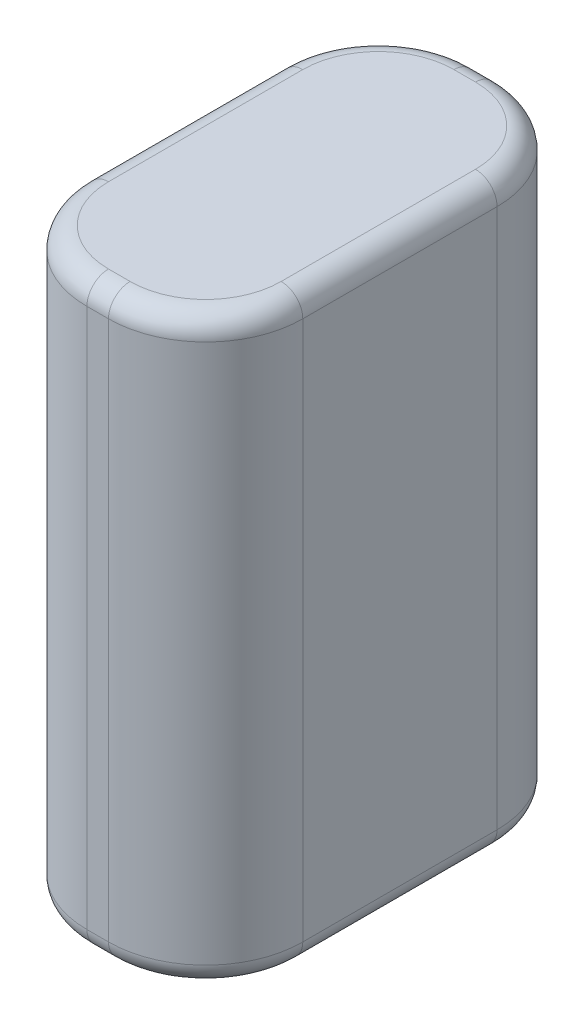
ISO-10303-21;
HEADER;
FILE_DESCRIPTION(('STEP AP214'),'2;1');
FILE_NAME('part.step','',(''),(''),'','','');
FILE_SCHEMA(('AUTOMOTIVE_DESIGN { 1 0 10303 214 1 1 1 1 }'));
ENDSEC;
DATA;
#1=APPLICATION_CONTEXT('core data for automotive mechanical design processes');
#2=APPLICATION_PROTOCOL_DEFINITION('international standard','automotive_design',2000,#1);
#3=PRODUCT_CONTEXT('',#1,'mechanical');
#4=PRODUCT('Part','Part','',(#3));
#5=PRODUCT_RELATED_PRODUCT_CATEGORY('part','',(#4));
#6=PRODUCT_DEFINITION_FORMATION('','',#4);
#7=PRODUCT_DEFINITION_CONTEXT('part definition',#1,'design');
#8=PRODUCT_DEFINITION('design','',#6,#7);
#9=PRODUCT_DEFINITION_SHAPE('','',#8);
#10=(LENGTH_UNIT() NAMED_UNIT(*) SI_UNIT(.MILLI.,.METRE.));
#11=(NAMED_UNIT(*) PLANE_ANGLE_UNIT() SI_UNIT($,.RADIAN.));
#12=(NAMED_UNIT(*) SI_UNIT($,.STERADIAN.) SOLID_ANGLE_UNIT());
#13=UNCERTAINTY_MEASURE_WITH_UNIT(LENGTH_MEASURE(1.E-05),#10,'distance_accuracy_value','');
#14=(GEOMETRIC_REPRESENTATION_CONTEXT(3) GLOBAL_UNCERTAINTY_ASSIGNED_CONTEXT((#13)) GLOBAL_UNIT_ASSIGNED_CONTEXT((#10,
#11,#12)) REPRESENTATION_CONTEXT('',''));
#15=CARTESIAN_POINT('',(0.,0.,0.));
#16=DIRECTION('',(0.,0.,1.));
#17=DIRECTION('',(1.,0.,0.));
#18=AXIS2_PLACEMENT_3D('',#15,#16,#17);
#19=CARTESIAN_POINT('',(5.,0.,9.));
#20=DIRECTION('',(1.,0.,0.));
#21=DIRECTION('',(0.,0.,-1.));
#22=AXIS2_PLACEMENT_3D('',#19,#20,#21);
#23=PLANE('',#22);
#24=DIRECTION('',(0.,-1.,0.));
#25=VECTOR('',#24,1.);
#26=CARTESIAN_POINT('',(5.,0.,-4.5));
#27=LINE('',#26,#25);
#28=CARTESIAN_POINT('',(5.,-1.,-4.5));
#29=VERTEX_POINT('',#28);
#30=CARTESIAN_POINT('',(5.,-26.,-4.49999999999999));
#31=VERTEX_POINT('',#30);
#32=EDGE_CURVE('E131',#29,#31,#27,.T.);
#33=ORIENTED_EDGE('',*,*,#32,.F.);
#34=DIRECTION('',(0.,0.,1.));
#35=VECTOR('',#34,1.);
#36=CARTESIAN_POINT('',(5.,-1.,-4.5));
#37=LINE('',#36,#35);
#38=CARTESIAN_POINT('',(5.,-1.,4.5));
#39=VERTEX_POINT('',#38);
#40=EDGE_CURVE('E178',#39,#29,#37,.F.);
#41=ORIENTED_EDGE('',*,*,#40,.F.);
#42=DIRECTION('',(0.,-1.,0.));
#43=VECTOR('',#42,1.);
#44=CARTESIAN_POINT('',(5.,0.,4.49999999999998));
#45=LINE('',#44,#43);
#46=CARTESIAN_POINT('',(5.,-26.,4.5));
#47=VERTEX_POINT('',#46);
#48=EDGE_CURVE('E133',#47,#39,#45,.F.);
#49=ORIENTED_EDGE('',*,*,#48,.F.);
#50=DIRECTION('',(0.,0.,-1.));
#51=VECTOR('',#50,1.);
#52=CARTESIAN_POINT('',(5.,-26.,4.5));
#53=LINE('',#52,#51);
#54=EDGE_CURVE('E127',#31,#47,#53,.F.);
#55=ORIENTED_EDGE('',*,*,#54,.F.);
#56=EDGE_LOOP('',(#33,#41,#49,#55));
#57=FACE_BOUND('',#56,.T.);
#58=ADVANCED_FACE('F17',(#57),#23,.T.);
#59=CARTESIAN_POINT('',(0.5,0.,-4.5));
#60=DIRECTION('',(0.,-1.,0.));
#61=DIRECTION('',(0.,0.,-1.));
#62=AXIS2_PLACEMENT_3D('',#59,#60,#61);
#63=CYLINDRICAL_SURFACE('',#62,4.5);
#64=CARTESIAN_POINT('',(0.5,-1.,-4.5));
#65=DIRECTION('',(0.,-1.,0.));
#66=DIRECTION('',(0.,0.,-1.));
#67=AXIS2_PLACEMENT_3D('',#64,#65,#66);
#68=CIRCLE('',#67,4.5);
#69=CARTESIAN_POINT('',(0.5,-1.,-9.));
#70=VERTEX_POINT('',#69);
#71=EDGE_CURVE('E152',#29,#70,#68,.F.);
#72=ORIENTED_EDGE('',*,*,#71,.F.);
#73=ORIENTED_EDGE('',*,*,#32,.T.);
#74=CARTESIAN_POINT('',(0.5,-26.,-4.5));
#75=DIRECTION('',(0.,1.,0.));
#76=DIRECTION('',(1.,0.,0.));
#77=AXIS2_PLACEMENT_3D('',#74,#75,#76);
#78=CIRCLE('',#77,4.5);
#79=CARTESIAN_POINT('',(0.5,-26.,-8.99999999999999));
#80=VERTEX_POINT('',#79);
#81=EDGE_CURVE('E145',#80,#31,#78,.F.);
#82=ORIENTED_EDGE('',*,*,#81,.F.);
#83=DIRECTION('',(0.,1.,0.));
#84=VECTOR('',#83,1.);
#85=CARTESIAN_POINT('',(0.5,0.,-9.));
#86=LINE('',#85,#84);
#87=EDGE_CURVE('E185',#70,#80,#86,.F.);
#88=ORIENTED_EDGE('',*,*,#87,.F.);
#89=EDGE_LOOP('',(#72,#73,#82,#88));
#90=FACE_BOUND('',#89,.T.);
#91=ADVANCED_FACE('F149',(#90),#63,.T.);
#92=CARTESIAN_POINT('',(0.5,-26.,4.5));
#93=DIRECTION('',(0.,1.,0.));
#94=DIRECTION('',(0.,0.,1.));
#95=AXIS2_PLACEMENT_3D('',#92,#93,#94);
#96=TOROIDAL_SURFACE('',#95,3.5,1.);
#97=CARTESIAN_POINT('',(4.,-26.,4.5));
#98=DIRECTION('',(0.,0.,-1.));
#99=DIRECTION('',(0.,1.,0.));
#100=AXIS2_PLACEMENT_3D('',#97,#98,#99);
#101=CIRCLE('',#100,1.);
#102=CARTESIAN_POINT('',(4.,-27.,4.5));
#103=VERTEX_POINT('',#102);
#104=EDGE_CURVE('E136',#47,#103,#101,.T.);
#105=ORIENTED_EDGE('',*,*,#104,.F.);
#106=CARTESIAN_POINT('',(0.5,-26.,4.50000000000002));
#107=DIRECTION('',(0.,-1.,0.));
#108=DIRECTION('',(0.,0.,-1.));
#109=AXIS2_PLACEMENT_3D('',#106,#107,#108);
#110=CIRCLE('',#109,4.5);
#111=CARTESIAN_POINT('',(0.5,-26.,9.00000000000001));
#112=VERTEX_POINT('',#111);
#113=EDGE_CURVE('E160',#112,#47,#110,.F.);
#114=ORIENTED_EDGE('',*,*,#113,.F.);
#115=CARTESIAN_POINT('',(0.5,-26.,8.));
#116=DIRECTION('',(1.,0.,0.));
#117=DIRECTION('',(0.,0.,-1.));
#118=AXIS2_PLACEMENT_3D('',#115,#116,#117);
#119=CIRCLE('',#118,1.);
#120=CARTESIAN_POINT('',(0.5,-27.,8.));
#121=VERTEX_POINT('',#120);
#122=EDGE_CURVE('E168',#121,#112,#119,.F.);
#123=ORIENTED_EDGE('',*,*,#122,.F.);
#124=CARTESIAN_POINT('',(0.5,-27.,4.5));
#125=DIRECTION('',(0.,1.,0.));
#126=DIRECTION('',(0.,0.,1.));
#127=AXIS2_PLACEMENT_3D('',#124,#125,#126);
#128=CIRCLE('',#127,3.5);
#129=EDGE_CURVE('E231',#121,#103,#128,.T.);
#130=ORIENTED_EDGE('',*,*,#129,.T.);
#131=EDGE_LOOP('',(#105,#114,#123,#130));
#132=FACE_BOUND('',#131,.T.);
#133=ADVANCED_FACE('F237',(#132),#96,.T.);
#134=CARTESIAN_POINT('',(4.,-26.,4.5));
#135=DIRECTION('',(0.,0.,-1.));
#136=DIRECTION('',(0.,1.,0.));
#137=AXIS2_PLACEMENT_3D('',#134,#135,#136);
#138=CYLINDRICAL_SURFACE('',#137,1.);
#139=ORIENTED_EDGE('',*,*,#54,.T.);
#140=ORIENTED_EDGE('',*,*,#104,.T.);
#141=DIRECTION('',(0.,0.,1.));
#142=VECTOR('',#141,1.);
#143=CARTESIAN_POINT('',(4.,-27.,0.));
#144=LINE('',#143,#142);
#145=CARTESIAN_POINT('',(4.,-27.,-4.5));
#146=VERTEX_POINT('',#145);
#147=EDGE_CURVE('E141',#103,#146,#144,.F.);
#148=ORIENTED_EDGE('',*,*,#147,.T.);
#149=CARTESIAN_POINT('',(4.,-26.,-4.5));
#150=DIRECTION('',(0.,0.,-1.));
#151=DIRECTION('',(1.,0.,0.));
#152=AXIS2_PLACEMENT_3D('',#149,#150,#151);
#153=CIRCLE('',#152,1.);
#154=EDGE_CURVE('E138',#31,#146,#153,.T.);
#155=ORIENTED_EDGE('',*,*,#154,.F.);
#156=EDGE_LOOP('',(#139,#140,#148,#155));
#157=FACE_BOUND('',#156,.T.);
#158=ADVANCED_FACE('F139',(#157),#138,.T.);
#159=CARTESIAN_POINT('',(0.5,-26.,-4.5));
#160=DIRECTION('',(0.,1.,0.));
#161=DIRECTION('',(1.,0.,0.));
#162=AXIS2_PLACEMENT_3D('',#159,#160,#161);
#163=TOROIDAL_SURFACE('',#162,3.5,1.);
#164=CARTESIAN_POINT('',(0.5,-26.,-8.));
#165=DIRECTION('',(-1.,0.,0.));
#166=DIRECTION('',(0.,0.,1.));
#167=AXIS2_PLACEMENT_3D('',#164,#165,#166);
#168=CIRCLE('',#167,1.);
#169=CARTESIAN_POINT('',(0.5,-27.,-8.));
#170=VERTEX_POINT('',#169);
#171=EDGE_CURVE('E157',#80,#170,#168,.T.);
#172=ORIENTED_EDGE('',*,*,#171,.F.);
#173=ORIENTED_EDGE('',*,*,#81,.T.);
#174=ORIENTED_EDGE('',*,*,#154,.T.);
#175=CARTESIAN_POINT('',(0.5,-27.,-4.5));
#176=DIRECTION('',(0.,1.,0.));
#177=DIRECTION('',(1.,0.,0.));
#178=AXIS2_PLACEMENT_3D('',#175,#176,#177);
#179=CIRCLE('',#178,3.5);
#180=EDGE_CURVE('E470',#146,#170,#179,.T.);
#181=ORIENTED_EDGE('',*,*,#180,.T.);
#182=EDGE_LOOP('',(#172,#173,#174,#181));
#183=FACE_BOUND('',#182,.T.);
#184=ADVANCED_FACE('F155',(#183),#163,.T.);
#185=CARTESIAN_POINT('',(0.5,-26.,-8.));
#186=DIRECTION('',(-1.,0.,0.));
#187=DIRECTION('',(0.,0.,1.));
#188=AXIS2_PLACEMENT_3D('',#185,#186,#187);
#189=CYLINDRICAL_SURFACE('',#188,1.);
#190=DIRECTION('',(1.,0.,0.));
#191=VECTOR('',#190,1.);
#192=CARTESIAN_POINT('',(5.,-26.,-8.99999999999998));
#193=LINE('',#192,#191);
#194=CARTESIAN_POINT('',(-0.5,-26.,-8.99999999999999));
#195=VERTEX_POINT('',#194);
#196=EDGE_CURVE('E188',#80,#195,#193,.F.);
#197=ORIENTED_EDGE('',*,*,#196,.F.);
#198=ORIENTED_EDGE('',*,*,#171,.T.);
#199=DIRECTION('',(1.,0.,0.));
#200=VECTOR('',#199,1.);
#201=CARTESIAN_POINT('',(0.,-27.,-8.));
#202=LINE('',#201,#200);
#203=CARTESIAN_POINT('',(-0.5,-27.,-8.));
#204=VERTEX_POINT('',#203);
#205=EDGE_CURVE('E468',#170,#204,#202,.F.);
#206=ORIENTED_EDGE('',*,*,#205,.T.);
#207=CARTESIAN_POINT('',(-0.5,-26.,-8.));
#208=DIRECTION('',(-1.,0.,0.));
#209=DIRECTION('',(0.,0.,-1.));
#210=AXIS2_PLACEMENT_3D('',#207,#208,#209);
#211=CIRCLE('',#210,1.);
#212=EDGE_CURVE('E278',#195,#204,#211,.T.);
#213=ORIENTED_EDGE('',*,*,#212,.F.);
#214=EDGE_LOOP('',(#197,#198,#206,#213));
#215=FACE_BOUND('',#214,.T.);
#216=ADVANCED_FACE('F267',(#215),#189,.T.);
#217=CARTESIAN_POINT('',(0.5,0.,4.5));
#218=DIRECTION('',(0.,-1.,0.));
#219=DIRECTION('',(0.,0.,-1.));
#220=AXIS2_PLACEMENT_3D('',#217,#218,#219);
#221=CYLINDRICAL_SURFACE('',#220,4.5);
#222=CARTESIAN_POINT('',(0.5,-1.,4.5));
#223=DIRECTION('',(0.,-1.,0.));
#224=DIRECTION('',(1.,0.,0.));
#225=AXIS2_PLACEMENT_3D('',#222,#223,#224);
#226=CIRCLE('',#225,4.5);
#227=CARTESIAN_POINT('',(0.5,-0.999999999999999,9.));
#228=VERTEX_POINT('',#227);
#229=EDGE_CURVE('E171',#228,#39,#226,.F.);
#230=ORIENTED_EDGE('',*,*,#229,.F.);
#231=DIRECTION('',(0.,-1.,0.));
#232=VECTOR('',#231,1.);
#233=CARTESIAN_POINT('',(0.5,0.,9.));
#234=LINE('',#233,#232);
#235=EDGE_CURVE('E501',#112,#228,#234,.F.);
#236=ORIENTED_EDGE('',*,*,#235,.F.);
#237=ORIENTED_EDGE('',*,*,#113,.T.);
#238=ORIENTED_EDGE('',*,*,#48,.T.);
#239=EDGE_LOOP('',(#230,#236,#237,#238));
#240=FACE_BOUND('',#239,.T.);
#241=ADVANCED_FACE('F622',(#240),#221,.T.);
#242=CARTESIAN_POINT('',(-0.5,-26.,8.));
#243=DIRECTION('',(1.,0.,0.));
#244=DIRECTION('',(0.,0.,-1.));
#245=AXIS2_PLACEMENT_3D('',#242,#243,#244);
#246=CYLINDRICAL_SURFACE('',#245,1.);
#247=DIRECTION('',(1.,0.,0.));
#248=VECTOR('',#247,1.);
#249=CARTESIAN_POINT('',(-5.,-26.,9.00000000000002));
#250=LINE('',#249,#248);
#251=CARTESIAN_POINT('',(-0.5,-26.,9.00000000000001));
#252=VERTEX_POINT('',#251);
#253=EDGE_CURVE('E464',#252,#112,#250,.T.);
#254=ORIENTED_EDGE('',*,*,#253,.F.);
#255=CARTESIAN_POINT('',(-0.5,-26.,8.));
#256=DIRECTION('',(1.,0.,0.));
#257=DIRECTION('',(0.,0.,1.));
#258=AXIS2_PLACEMENT_3D('',#255,#256,#257);
#259=CIRCLE('',#258,1.);
#260=CARTESIAN_POINT('',(-0.5,-27.,8.));
#261=VERTEX_POINT('',#260);
#262=EDGE_CURVE('E593',#261,#252,#259,.F.);
#263=ORIENTED_EDGE('',*,*,#262,.F.);
#264=DIRECTION('',(1.,0.,0.));
#265=VECTOR('',#264,1.);
#266=CARTESIAN_POINT('',(0.,-27.,8.));
#267=LINE('',#266,#265);
#268=EDGE_CURVE('E456',#261,#121,#267,.T.);
#269=ORIENTED_EDGE('',*,*,#268,.T.);
#270=ORIENTED_EDGE('',*,*,#122,.T.);
#271=EDGE_LOOP('',(#254,#263,#269,#270));
#272=FACE_BOUND('',#271,.T.);
#273=ADVANCED_FACE('F627',(#272),#246,.T.);
#274=CARTESIAN_POINT('',(0.5,-1.,8.));
#275=DIRECTION('',(-1.,0.,0.));
#276=DIRECTION('',(0.,0.,1.));
#277=AXIS2_PLACEMENT_3D('',#274,#275,#276);
#278=CYLINDRICAL_SURFACE('',#277,1.);
#279=DIRECTION('',(1.,0.,0.));
#280=VECTOR('',#279,1.);
#281=CARTESIAN_POINT('',(-5.,-1.,9.));
#282=LINE('',#281,#280);
#283=CARTESIAN_POINT('',(-0.5,-1.,9.));
#284=VERTEX_POINT('',#283);
#285=EDGE_CURVE('E504',#228,#284,#282,.F.);
#286=ORIENTED_EDGE('',*,*,#285,.F.);
#287=CARTESIAN_POINT('',(0.5,-0.999999999999999,8.));
#288=DIRECTION('',(-1.,0.,0.));
#289=DIRECTION('',(0.,0.,1.));
#290=AXIS2_PLACEMENT_3D('',#287,#288,#289);
#291=CIRCLE('',#290,1.);
#292=CARTESIAN_POINT('',(0.5,0.,8.));
#293=VERTEX_POINT('',#292);
#294=EDGE_CURVE('E175',#293,#228,#291,.F.);
#295=ORIENTED_EDGE('',*,*,#294,.F.);
#296=DIRECTION('',(1.,0.,0.));
#297=VECTOR('',#296,1.);
#298=CARTESIAN_POINT('',(0.,0.,8.));
#299=LINE('',#298,#297);
#300=CARTESIAN_POINT('',(-0.5,0.,8.));
#301=VERTEX_POINT('',#300);
#302=EDGE_CURVE('E527',#301,#293,#299,.T.);
#303=ORIENTED_EDGE('',*,*,#302,.F.);
#304=CARTESIAN_POINT('',(-0.5,-0.999999999999999,8.));
#305=DIRECTION('',(-1.,0.,0.));
#306=DIRECTION('',(0.,0.,1.));
#307=AXIS2_PLACEMENT_3D('',#304,#305,#306);
#308=CIRCLE('',#307,1.);
#309=EDGE_CURVE('E392',#284,#301,#308,.T.);
#310=ORIENTED_EDGE('',*,*,#309,.F.);
#311=EDGE_LOOP('',(#286,#295,#303,#310));
#312=FACE_BOUND('',#311,.T.);
#313=ADVANCED_FACE('F369',(#312),#278,.T.);
#314=CARTESIAN_POINT('',(0.5,-1.,4.5));
#315=DIRECTION('',(0.,-1.,0.));
#316=DIRECTION('',(1.,0.,0.));
#317=AXIS2_PLACEMENT_3D('',#314,#315,#316);
#318=TOROIDAL_SURFACE('',#317,3.5,1.);
#319=ORIENTED_EDGE('',*,*,#294,.T.);
#320=ORIENTED_EDGE('',*,*,#229,.T.);
#321=CARTESIAN_POINT('',(4.,-0.999999999999998,4.5));
#322=DIRECTION('',(0.,0.,1.));
#323=DIRECTION('',(0.,-1.,0.));
#324=AXIS2_PLACEMENT_3D('',#321,#322,#323);
#325=CIRCLE('',#324,1.);
#326=CARTESIAN_POINT('',(4.,0.,4.5));
#327=VERTEX_POINT('',#326);
#328=EDGE_CURVE('E174',#327,#39,#325,.F.);
#329=ORIENTED_EDGE('',*,*,#328,.F.);
#330=CARTESIAN_POINT('',(0.5,0.,4.5));
#331=DIRECTION('',(0.,-1.,0.));
#332=DIRECTION('',(1.,0.,0.));
#333=AXIS2_PLACEMENT_3D('',#330,#331,#332);
#334=CIRCLE('',#333,3.5);
#335=EDGE_CURVE('E530',#293,#327,#334,.F.);
#336=ORIENTED_EDGE('',*,*,#335,.F.);
#337=EDGE_LOOP('',(#319,#320,#329,#336));
#338=FACE_BOUND('',#337,.T.);
#339=ADVANCED_FACE('F365',(#338),#318,.T.);
#340=CARTESIAN_POINT('',(4.,-1.,-4.5));
#341=DIRECTION('',(0.,0.,1.));
#342=DIRECTION('',(0.,-1.,0.));
#343=AXIS2_PLACEMENT_3D('',#340,#341,#342);
#344=CYLINDRICAL_SURFACE('',#343,1.);
#345=ORIENTED_EDGE('',*,*,#40,.T.);
#346=CARTESIAN_POINT('',(4.,-1.,-4.5));
#347=DIRECTION('',(0.,0.,1.));
#348=DIRECTION('',(1.,0.,0.));
#349=AXIS2_PLACEMENT_3D('',#346,#347,#348);
#350=CIRCLE('',#349,1.);
#351=CARTESIAN_POINT('',(4.,0.,-4.5));
#352=VERTEX_POINT('',#351);
#353=EDGE_CURVE('E180',#352,#29,#350,.F.);
#354=ORIENTED_EDGE('',*,*,#353,.F.);
#355=DIRECTION('',(0.,0.,1.));
#356=VECTOR('',#355,1.);
#357=CARTESIAN_POINT('',(4.,0.,0.));
#358=LINE('',#357,#356);
#359=EDGE_CURVE('E533',#327,#352,#358,.F.);
#360=ORIENTED_EDGE('',*,*,#359,.F.);
#361=ORIENTED_EDGE('',*,*,#328,.T.);
#362=EDGE_LOOP('',(#345,#354,#360,#361));
#363=FACE_BOUND('',#362,.T.);
#364=ADVANCED_FACE('F343',(#363),#344,.T.);
#365=CARTESIAN_POINT('',(0.5,-1.,-4.5));
#366=DIRECTION('',(0.,-1.,0.));
#367=DIRECTION('',(0.,0.,-1.));
#368=AXIS2_PLACEMENT_3D('',#365,#366,#367);
#369=TOROIDAL_SURFACE('',#368,3.5,1.);
#370=ORIENTED_EDGE('',*,*,#353,.T.);
#371=ORIENTED_EDGE('',*,*,#71,.T.);
#372=CARTESIAN_POINT('',(0.5,-1.,-8.));
#373=DIRECTION('',(1.,0.,0.));
#374=DIRECTION('',(0.,0.,-1.));
#375=AXIS2_PLACEMENT_3D('',#372,#373,#374);
#376=CIRCLE('',#375,1.);
#377=CARTESIAN_POINT('',(0.5,0.,-8.));
#378=VERTEX_POINT('',#377);
#379=EDGE_CURVE('E193',#378,#70,#376,.F.);
#380=ORIENTED_EDGE('',*,*,#379,.F.);
#381=CARTESIAN_POINT('',(0.5,0.,-4.5));
#382=DIRECTION('',(0.,-1.,0.));
#383=DIRECTION('',(0.,0.,-1.));
#384=AXIS2_PLACEMENT_3D('',#381,#382,#383);
#385=CIRCLE('',#384,3.5);
#386=EDGE_CURVE('E536',#352,#378,#385,.F.);
#387=ORIENTED_EDGE('',*,*,#386,.F.);
#388=EDGE_LOOP('',(#370,#371,#380,#387));
#389=FACE_BOUND('',#388,.T.);
#390=ADVANCED_FACE('F339',(#389),#369,.T.);
#391=CARTESIAN_POINT('',(-0.5,-1.,-8.));
#392=DIRECTION('',(1.,0.,0.));
#393=DIRECTION('',(0.,0.,-1.));
#394=AXIS2_PLACEMENT_3D('',#391,#392,#393);
#395=CYLINDRICAL_SURFACE('',#394,1.);
#396=DIRECTION('',(1.,0.,0.));
#397=VECTOR('',#396,1.);
#398=CARTESIAN_POINT('',(5.,-1.,-9.));
#399=LINE('',#398,#397);
#400=CARTESIAN_POINT('',(-0.5,-1.,-9.));
#401=VERTEX_POINT('',#400);
#402=EDGE_CURVE('E198',#401,#70,#399,.T.);
#403=ORIENTED_EDGE('',*,*,#402,.F.);
#404=CARTESIAN_POINT('',(-0.5,-1.,-8.));
#405=DIRECTION('',(1.,0.,0.));
#406=DIRECTION('',(0.,0.,-1.));
#407=AXIS2_PLACEMENT_3D('',#404,#405,#406);
#408=CIRCLE('',#407,1.);
#409=CARTESIAN_POINT('',(-0.5,0.,-8.));
#410=VERTEX_POINT('',#409);
#411=EDGE_CURVE('E189',#410,#401,#408,.F.);
#412=ORIENTED_EDGE('',*,*,#411,.F.);
#413=DIRECTION('',(1.,0.,0.));
#414=VECTOR('',#413,1.);
#415=CARTESIAN_POINT('',(0.,0.,-8.));
#416=LINE('',#415,#414);
#417=EDGE_CURVE('E539',#378,#410,#416,.F.);
#418=ORIENTED_EDGE('',*,*,#417,.F.);
#419=ORIENTED_EDGE('',*,*,#379,.T.);
#420=EDGE_LOOP('',(#403,#412,#418,#419));
#421=FACE_BOUND('',#420,.T.);
#422=ADVANCED_FACE('F301',(#421),#395,.T.);
#423=CARTESIAN_POINT('',(-0.5,-26.,-4.5));
#424=DIRECTION('',(0.,1.,0.));
#425=DIRECTION('',(0.,0.,-1.));
#426=AXIS2_PLACEMENT_3D('',#423,#424,#425);
#427=TOROIDAL_SURFACE('',#426,3.5,1.);
#428=CARTESIAN_POINT('',(-4.,-26.,-4.5));
#429=DIRECTION('',(0.,0.,1.));
#430=DIRECTION('',(-1.,0.,0.));
#431=AXIS2_PLACEMENT_3D('',#428,#429,#430);
#432=CIRCLE('',#431,1.);
#433=CARTESIAN_POINT('',(-4.,-27.,-4.5));
#434=VERTEX_POINT('',#433);
#435=CARTESIAN_POINT('',(-5.,-26.,-4.5));
#436=VERTEX_POINT('',#435);
#437=EDGE_CURVE('E275',#434,#436,#432,.F.);
#438=ORIENTED_EDGE('',*,*,#437,.T.);
#439=CARTESIAN_POINT('',(-0.5,-26.,-4.49999999999998));
#440=DIRECTION('',(0.,-1.,0.));
#441=DIRECTION('',(0.,0.,-1.));
#442=AXIS2_PLACEMENT_3D('',#439,#440,#441);
#443=CIRCLE('',#442,4.5);
#444=EDGE_CURVE('E207',#195,#436,#443,.F.);
#445=ORIENTED_EDGE('',*,*,#444,.F.);
#446=ORIENTED_EDGE('',*,*,#212,.T.);
#447=CARTESIAN_POINT('',(-0.5,-27.,-4.5));
#448=DIRECTION('',(0.,1.,0.));
#449=DIRECTION('',(0.,0.,-1.));
#450=AXIS2_PLACEMENT_3D('',#447,#448,#449);
#451=CIRCLE('',#450,3.5);
#452=EDGE_CURVE('E465',#204,#434,#451,.T.);
#453=ORIENTED_EDGE('',*,*,#452,.T.);
#454=EDGE_LOOP('',(#438,#445,#446,#453));
#455=FACE_BOUND('',#454,.T.);
#456=ADVANCED_FACE('F289',(#455),#427,.T.);
#457=CARTESIAN_POINT('',(-0.5,-1.,-4.5));
#458=DIRECTION('',(0.,-1.,0.));
#459=DIRECTION('',(-1.,0.,0.));
#460=AXIS2_PLACEMENT_3D('',#457,#458,#459);
#461=TOROIDAL_SURFACE('',#460,3.5,1.);
#462=ORIENTED_EDGE('',*,*,#411,.T.);
#463=CARTESIAN_POINT('',(-0.5,-1.,-4.5));
#464=DIRECTION('',(0.,-1.,0.));
#465=DIRECTION('',(0.,0.,-1.));
#466=AXIS2_PLACEMENT_3D('',#463,#464,#465);
#467=CIRCLE('',#466,4.5);
#468=CARTESIAN_POINT('',(-5.,-1.,-4.5));
#469=VERTEX_POINT('',#468);
#470=EDGE_CURVE('E210',#469,#401,#467,.T.);
#471=ORIENTED_EDGE('',*,*,#470,.F.);
#472=CARTESIAN_POINT('',(-4.,-1.,-4.5));
#473=DIRECTION('',(0.,0.,-1.));
#474=DIRECTION('',(-1.,0.,0.));
#475=AXIS2_PLACEMENT_3D('',#472,#473,#474);
#476=CIRCLE('',#475,1.);
#477=CARTESIAN_POINT('',(-4.,0.,-4.5));
#478=VERTEX_POINT('',#477);
#479=EDGE_CURVE('E277',#469,#478,#476,.T.);
#480=ORIENTED_EDGE('',*,*,#479,.T.);
#481=CARTESIAN_POINT('',(-0.5,0.,-4.5));
#482=DIRECTION('',(0.,-1.,0.));
#483=DIRECTION('',(-1.,0.,0.));
#484=AXIS2_PLACEMENT_3D('',#481,#482,#483);
#485=CIRCLE('',#484,3.5);
#486=EDGE_CURVE('E211',#410,#478,#485,.F.);
#487=ORIENTED_EDGE('',*,*,#486,.F.);
#488=EDGE_LOOP('',(#462,#471,#480,#487));
#489=FACE_BOUND('',#488,.T.);
#490=ADVANCED_FACE('F300',(#489),#461,.T.);
#491=CARTESIAN_POINT('',(5.,0.,-9.));
#492=DIRECTION('',(0.,0.,-1.));
#493=DIRECTION('',(0.,1.,0.));
#494=AXIS2_PLACEMENT_3D('',#491,#492,#493);
#495=PLANE('',#494);
#496=DIRECTION('',(0.,-1.,0.));
#497=VECTOR('',#496,1.);
#498=CARTESIAN_POINT('',(-0.5,0.,-9.));
#499=LINE('',#498,#497);
#500=EDGE_CURVE('E221',#401,#195,#499,.T.);
#501=ORIENTED_EDGE('',*,*,#500,.F.);
#502=ORIENTED_EDGE('',*,*,#402,.T.);
#503=ORIENTED_EDGE('',*,*,#87,.T.);
#504=ORIENTED_EDGE('',*,*,#196,.T.);
#505=EDGE_LOOP('',(#501,#502,#503,#504));
#506=FACE_BOUND('',#505,.T.);
#507=ADVANCED_FACE('F430',(#506),#495,.T.);
#508=CARTESIAN_POINT('',(0.,-27.,0.));
#509=DIRECTION('',(0.,1.,0.));
#510=DIRECTION('',(0.,0.,1.));
#511=AXIS2_PLACEMENT_3D('',#508,#509,#510);
#512=PLANE('',#511);
#513=CARTESIAN_POINT('',(-0.5,-27.,4.5));
#514=DIRECTION('',(0.,1.,0.));
#515=DIRECTION('',(-1.,0.,0.));
#516=AXIS2_PLACEMENT_3D('',#513,#514,#515);
#517=CIRCLE('',#516,3.5);
#518=CARTESIAN_POINT('',(-4.,-27.,4.5));
#519=VERTEX_POINT('',#518);
#520=EDGE_CURVE('E451',#519,#261,#517,.T.);
#521=ORIENTED_EDGE('',*,*,#520,.F.);
#522=DIRECTION('',(0.,0.,1.));
#523=VECTOR('',#522,1.);
#524=CARTESIAN_POINT('',(-4.,-27.,-4.5));
#525=LINE('',#524,#523);
#526=EDGE_CURVE('E226',#434,#519,#525,.T.);
#527=ORIENTED_EDGE('',*,*,#526,.F.);
#528=ORIENTED_EDGE('',*,*,#452,.F.);
#529=ORIENTED_EDGE('',*,*,#205,.F.);
#530=ORIENTED_EDGE('',*,*,#180,.F.);
#531=ORIENTED_EDGE('',*,*,#147,.F.);
#532=ORIENTED_EDGE('',*,*,#129,.F.);
#533=ORIENTED_EDGE('',*,*,#268,.F.);
#534=EDGE_LOOP('',(#521,#527,#528,#529,#530,#531,#532,#533));
#535=FACE_BOUND('',#534,.T.);
#536=ADVANCED_FACE('F422',(#535),#512,.F.);
#537=CARTESIAN_POINT('',(-5.,0.,9.));
#538=DIRECTION('',(0.,0.,1.));
#539=DIRECTION('',(0.,-1.,0.));
#540=AXIS2_PLACEMENT_3D('',#537,#538,#539);
#541=PLANE('',#540);
#542=ORIENTED_EDGE('',*,*,#235,.T.);
#543=ORIENTED_EDGE('',*,*,#285,.T.);
#544=DIRECTION('',(0.,-1.,0.));
#545=VECTOR('',#544,1.);
#546=CARTESIAN_POINT('',(-0.499999999999999,0.,9.));
#547=LINE('',#546,#545);
#548=EDGE_CURVE('E482',#252,#284,#547,.F.);
#549=ORIENTED_EDGE('',*,*,#548,.F.);
#550=ORIENTED_EDGE('',*,*,#253,.T.);
#551=EDGE_LOOP('',(#542,#543,#549,#550));
#552=FACE_BOUND('',#551,.T.);
#553=ADVANCED_FACE('F406',(#552),#541,.T.);
#554=CARTESIAN_POINT('',(-0.5,-1.,4.5));
#555=DIRECTION('',(0.,-1.,0.));
#556=DIRECTION('',(0.,0.,1.));
#557=AXIS2_PLACEMENT_3D('',#554,#555,#556);
#558=TOROIDAL_SURFACE('',#557,3.5,1.);
#559=CARTESIAN_POINT('',(-4.,-1.,4.5));
#560=DIRECTION('',(0.,0.,-1.));
#561=DIRECTION('',(-1.,0.,0.));
#562=AXIS2_PLACEMENT_3D('',#559,#560,#561);
#563=CIRCLE('',#562,1.);
#564=CARTESIAN_POINT('',(-4.,0.,4.5));
#565=VERTEX_POINT('',#564);
#566=CARTESIAN_POINT('',(-5.,-1.,4.5));
#567=VERTEX_POINT('',#566);
#568=EDGE_CURVE('E35',#565,#567,#563,.F.);
#569=ORIENTED_EDGE('',*,*,#568,.T.);
#570=CARTESIAN_POINT('',(-0.5,-1.,4.5));
#571=DIRECTION('',(0.,-1.,0.));
#572=DIRECTION('',(0.,0.,-1.));
#573=AXIS2_PLACEMENT_3D('',#570,#571,#572);
#574=CIRCLE('',#573,4.5);
#575=EDGE_CURVE('E488',#284,#567,#574,.T.);
#576=ORIENTED_EDGE('',*,*,#575,.F.);
#577=ORIENTED_EDGE('',*,*,#309,.T.);
#578=CARTESIAN_POINT('',(-0.5,0.,4.5));
#579=DIRECTION('',(0.,-1.,0.));
#580=DIRECTION('',(0.,0.,1.));
#581=AXIS2_PLACEMENT_3D('',#578,#579,#580);
#582=CIRCLE('',#581,3.5);
#583=EDGE_CURVE('E386',#565,#301,#582,.F.);
#584=ORIENTED_EDGE('',*,*,#583,.F.);
#585=EDGE_LOOP('',(#569,#576,#577,#584));
#586=FACE_BOUND('',#585,.T.);
#587=ADVANCED_FACE('F394',(#586),#558,.T.);
#588=CARTESIAN_POINT('',(-0.5,-26.,4.5));
#589=DIRECTION('',(0.,1.,0.));
#590=DIRECTION('',(-1.,0.,0.));
#591=AXIS2_PLACEMENT_3D('',#588,#589,#590);
#592=TOROIDAL_SURFACE('',#591,3.5,1.);
#593=ORIENTED_EDGE('',*,*,#262,.T.);
#594=CARTESIAN_POINT('',(-0.5,-26.,4.50000000000002));
#595=DIRECTION('',(0.,-1.,0.));
#596=DIRECTION('',(0.,0.,-1.));
#597=AXIS2_PLACEMENT_3D('',#594,#595,#596);
#598=CIRCLE('',#597,4.5);
#599=CARTESIAN_POINT('',(-5.,-26.,4.50000000000001));
#600=VERTEX_POINT('',#599);
#601=EDGE_CURVE('E493',#600,#252,#598,.F.);
#602=ORIENTED_EDGE('',*,*,#601,.F.);
#603=CARTESIAN_POINT('',(-4.,-26.,4.5));
#604=DIRECTION('',(0.,0.,1.));
#605=DIRECTION('',(0.,-1.,0.));
#606=AXIS2_PLACEMENT_3D('',#603,#604,#605);
#607=CIRCLE('',#606,1.);
#608=EDGE_CURVE('E478',#519,#600,#607,.F.);
#609=ORIENTED_EDGE('',*,*,#608,.F.);
#610=ORIENTED_EDGE('',*,*,#520,.T.);
#611=EDGE_LOOP('',(#593,#602,#609,#610));
#612=FACE_BOUND('',#611,.T.);
#613=ADVANCED_FACE('F405',(#612),#592,.T.);
#614=CARTESIAN_POINT('',(0.,0.,0.));
#615=DIRECTION('',(0.,1.,0.));
#616=DIRECTION('',(0.,0.,1.));
#617=AXIS2_PLACEMENT_3D('',#614,#615,#616);
#618=PLANE('',#617);
#619=ORIENTED_EDGE('',*,*,#486,.T.);
#620=DIRECTION('',(0.,0.,-1.));
#621=VECTOR('',#620,1.);
#622=CARTESIAN_POINT('',(-4.,0.,4.5));
#623=LINE('',#622,#621);
#624=EDGE_CURVE('E216',#565,#478,#623,.T.);
#625=ORIENTED_EDGE('',*,*,#624,.F.);
#626=ORIENTED_EDGE('',*,*,#583,.T.);
#627=ORIENTED_EDGE('',*,*,#302,.T.);
#628=ORIENTED_EDGE('',*,*,#335,.T.);
#629=ORIENTED_EDGE('',*,*,#359,.T.);
#630=ORIENTED_EDGE('',*,*,#386,.T.);
#631=ORIENTED_EDGE('',*,*,#417,.T.);
#632=EDGE_LOOP('',(#619,#625,#626,#627,#628,#629,#630,#631));
#633=FACE_BOUND('',#632,.T.);
#634=ADVANCED_FACE('F545',(#633),#618,.T.);
#635=CARTESIAN_POINT('',(-0.5,0.,-4.5));
#636=DIRECTION('',(0.,-1.,0.));
#637=DIRECTION('',(0.,0.,-1.));
#638=AXIS2_PLACEMENT_3D('',#635,#636,#637);
#639=CYLINDRICAL_SURFACE('',#638,4.5);
#640=ORIENTED_EDGE('',*,*,#470,.T.);
#641=ORIENTED_EDGE('',*,*,#500,.T.);
#642=ORIENTED_EDGE('',*,*,#444,.T.);
#643=DIRECTION('',(0.,1.,0.));
#644=VECTOR('',#643,1.);
#645=CARTESIAN_POINT('',(-5.,0.,-4.5));
#646=LINE('',#645,#644);
#647=EDGE_CURVE('E204',#469,#436,#646,.F.);
#648=ORIENTED_EDGE('',*,*,#647,.F.);
#649=EDGE_LOOP('',(#640,#641,#642,#648));
#650=FACE_BOUND('',#649,.T.);
#651=ADVANCED_FACE('F554',(#650),#639,.T.);
#652=CARTESIAN_POINT('',(-4.,-26.,-4.5));
#653=DIRECTION('',(0.,0.,1.));
#654=DIRECTION('',(0.,-1.,0.));
#655=AXIS2_PLACEMENT_3D('',#652,#653,#654);
#656=CYLINDRICAL_SURFACE('',#655,1.);
#657=DIRECTION('',(0.,0.,1.));
#658=VECTOR('',#657,1.);
#659=CARTESIAN_POINT('',(-5.,-26.,-9.));
#660=LINE('',#659,#658);
#661=EDGE_CURVE('E201',#436,#600,#660,.T.);
#662=ORIENTED_EDGE('',*,*,#661,.F.);
#663=ORIENTED_EDGE('',*,*,#437,.F.);
#664=ORIENTED_EDGE('',*,*,#526,.T.);
#665=ORIENTED_EDGE('',*,*,#608,.T.);
#666=EDGE_LOOP('',(#662,#663,#664,#665));
#667=FACE_BOUND('',#666,.T.);
#668=ADVANCED_FACE('F618',(#667),#656,.T.);
#669=CARTESIAN_POINT('',(-0.5,0.,4.5));
#670=DIRECTION('',(0.,-1.,0.));
#671=DIRECTION('',(0.,0.,-1.));
#672=AXIS2_PLACEMENT_3D('',#669,#670,#671);
#673=CYLINDRICAL_SURFACE('',#672,4.5);
#674=DIRECTION('',(0.,1.,0.));
#675=VECTOR('',#674,1.);
#676=CARTESIAN_POINT('',(-5.,0.,4.5));
#677=LINE('',#676,#675);
#678=EDGE_CURVE('E26',#600,#567,#677,.T.);
#679=ORIENTED_EDGE('',*,*,#678,.F.);
#680=ORIENTED_EDGE('',*,*,#601,.T.);
#681=ORIENTED_EDGE('',*,*,#548,.T.);
#682=ORIENTED_EDGE('',*,*,#575,.T.);
#683=EDGE_LOOP('',(#679,#680,#681,#682));
#684=FACE_BOUND('',#683,.T.);
#685=ADVANCED_FACE('F634',(#684),#673,.T.);
#686=CARTESIAN_POINT('',(-4.,-1.,4.5));
#687=DIRECTION('',(0.,0.,-1.));
#688=DIRECTION('',(0.,1.,0.));
#689=AXIS2_PLACEMENT_3D('',#686,#687,#688);
#690=CYLINDRICAL_SURFACE('',#689,1.);
#691=DIRECTION('',(0.,0.,1.));
#692=VECTOR('',#691,1.);
#693=CARTESIAN_POINT('',(-5.,-1.,-9.));
#694=LINE('',#693,#692);
#695=EDGE_CURVE('E11',#567,#469,#694,.F.);
#696=ORIENTED_EDGE('',*,*,#695,.F.);
#697=ORIENTED_EDGE('',*,*,#568,.F.);
#698=ORIENTED_EDGE('',*,*,#624,.T.);
#699=ORIENTED_EDGE('',*,*,#479,.F.);
#700=EDGE_LOOP('',(#696,#697,#698,#699));
#701=FACE_BOUND('',#700,.T.);
#702=ADVANCED_FACE('F591',(#701),#690,.T.);
#703=CARTESIAN_POINT('',(-5.,0.,-9.));
#704=DIRECTION('',(-1.,0.,0.));
#705=DIRECTION('',(0.,0.,1.));
#706=AXIS2_PLACEMENT_3D('',#703,#704,#705);
#707=PLANE('',#706);
#708=ORIENTED_EDGE('',*,*,#678,.T.);
#709=ORIENTED_EDGE('',*,*,#695,.T.);
#710=ORIENTED_EDGE('',*,*,#647,.T.);
#711=ORIENTED_EDGE('',*,*,#661,.T.);
#712=EDGE_LOOP('',(#708,#709,#710,#711));
#713=FACE_BOUND('',#712,.T.);
#714=ADVANCED_FACE('F590',(#713),#707,.T.);
#715=CLOSED_SHELL('',(#58,#91,#133,#158,#184,#216,#241,#273,#313,#339,#364,#390,#422,#456,#490,
#507,#536,#553,#587,#613,#634,#651,#668,#685,#702,#714));
#716=MANIFOLD_SOLID_BREP('B1',#715);
#717=ADVANCED_BREP_SHAPE_REPRESENTATION('',(#18,#716),#14);
#718=SHAPE_DEFINITION_REPRESENTATION(#9,#717);
ENDSEC;
END-ISO-10303-21;
